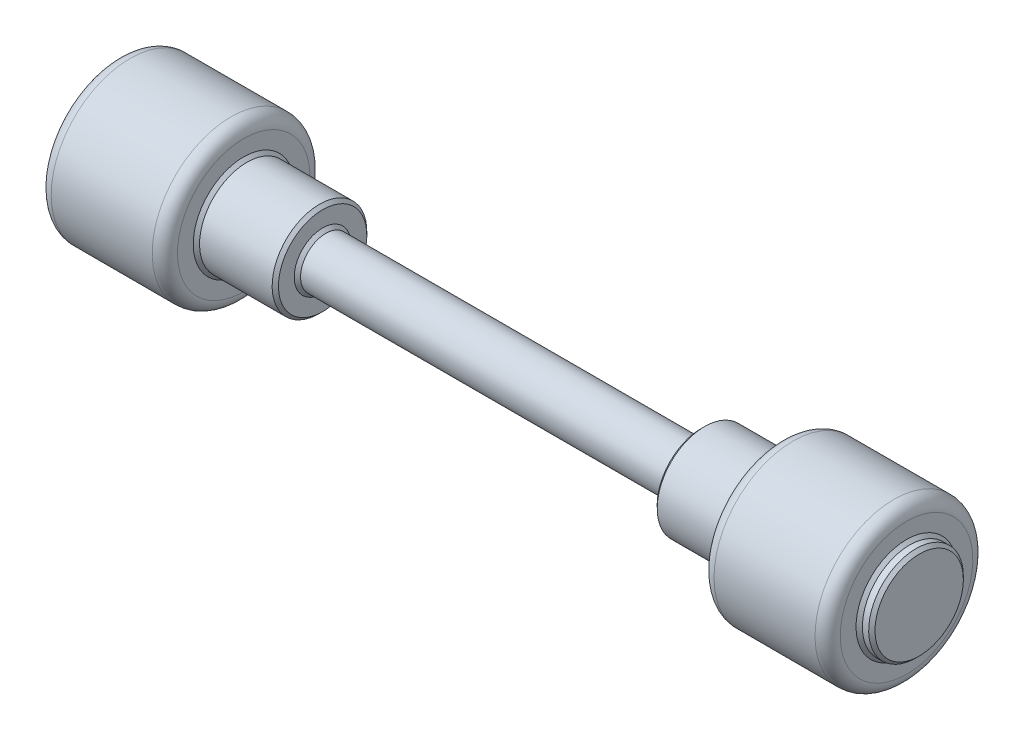
ISO-10303-21;
HEADER;
FILE_DESCRIPTION(('STEP AP214'),'2;1');
FILE_NAME('part.step','',(''),(''),'','','');
FILE_SCHEMA(('AUTOMOTIVE_DESIGN { 1 0 10303 214 1 1 1 1 }'));
ENDSEC;
DATA;
#1=APPLICATION_CONTEXT('core data for automotive mechanical design processes');
#2=APPLICATION_PROTOCOL_DEFINITION('international standard','automotive_design',2000,#1);
#3=PRODUCT_CONTEXT('',#1,'mechanical');
#4=PRODUCT('Part','Part','',(#3));
#5=PRODUCT_RELATED_PRODUCT_CATEGORY('part','',(#4));
#6=PRODUCT_DEFINITION_FORMATION('','',#4);
#7=PRODUCT_DEFINITION_CONTEXT('part definition',#1,'design');
#8=PRODUCT_DEFINITION('design','',#6,#7);
#9=PRODUCT_DEFINITION_SHAPE('','',#8);
#10=(LENGTH_UNIT() NAMED_UNIT(*) SI_UNIT(.MILLI.,.METRE.));
#11=(NAMED_UNIT(*) PLANE_ANGLE_UNIT() SI_UNIT($,.RADIAN.));
#12=(NAMED_UNIT(*) SI_UNIT($,.STERADIAN.) SOLID_ANGLE_UNIT());
#13=UNCERTAINTY_MEASURE_WITH_UNIT(LENGTH_MEASURE(1.E-05),#10,'distance_accuracy_value','');
#14=(GEOMETRIC_REPRESENTATION_CONTEXT(3) GLOBAL_UNCERTAINTY_ASSIGNED_CONTEXT((#13)) GLOBAL_UNIT_ASSIGNED_CONTEXT((#10,
#11,#12)) REPRESENTATION_CONTEXT('',''));
#15=CARTESIAN_POINT('',(0.,0.,0.));
#16=DIRECTION('',(0.,0.,1.));
#17=DIRECTION('',(1.,0.,0.));
#18=AXIS2_PLACEMENT_3D('',#15,#16,#17);
#19=CARTESIAN_POINT('',(1612.5,0.,0.));
#20=DIRECTION('',(1.,0.,0.));
#21=DIRECTION('',(0.,1.,0.));
#22=AXIS2_PLACEMENT_3D('',#19,#20,#21);
#23=CYLINDRICAL_SURFACE('',#22,312.500000000001);
#24=CARTESIAN_POINT('',(-1112.5,-3.49024337756995E-13,0.));
#25=DIRECTION('',(1.,0.,0.));
#26=DIRECTION('',(0.,1.,0.));
#27=AXIS2_PLACEMENT_3D('',#24,#25,#26);
#28=CIRCLE('',#27,312.500000000001);
#29=CARTESIAN_POINT('',(-1112.5,312.5,0.));
#30=VERTEX_POINT('',#29);
#31=EDGE_CURVE('E47',#30,#30,#28,.F.);
#32=ORIENTED_EDGE('',*,*,#31,.T.);
#33=EDGE_LOOP('',(#32));
#34=FACE_BOUND('',#33,.T.);
#35=CARTESIAN_POINT('',(-1512.5,-3.9801020972289E-13,0.));
#36=DIRECTION('',(-1.,0.,0.));
#37=DIRECTION('',(0.,-1.,0.));
#38=AXIS2_PLACEMENT_3D('',#35,#36,#37);
#39=CIRCLE('',#38,312.500000000001);
#40=CARTESIAN_POINT('',(-1512.5,-312.500000000001,0.));
#41=VERTEX_POINT('',#40);
#42=EDGE_CURVE('E52',#41,#41,#39,.F.);
#43=ORIENTED_EDGE('',*,*,#42,.T.);
#44=EDGE_LOOP('',(#43));
#45=FACE_BOUND('',#44,.T.);
#46=ADVANCED_FACE('F39',(#34,#45),#23,.T.);
#47=CARTESIAN_POINT('',(-1062.5,312.5,0.));
#48=DIRECTION('',(1.,0.,0.));
#49=DIRECTION('',(0.,1.,0.));
#50=AXIS2_PLACEMENT_3D('',#47,#48,#49);
#51=PLANE('',#50);
#52=CARTESIAN_POINT('',(-1062.5,-3.42901103761259E-13,0.));
#53=DIRECTION('',(1.,0.,0.));
#54=DIRECTION('',(0.,1.,0.));
#55=AXIS2_PLACEMENT_3D('',#52,#53,#54);
#56=CIRCLE('',#55,262.500000000001);
#57=CARTESIAN_POINT('',(-1062.5,262.5,0.));
#58=VERTEX_POINT('',#57);
#59=EDGE_CURVE('E57',#58,#58,#56,.T.);
#60=ORIENTED_EDGE('',*,*,#59,.T.);
#61=EDGE_LOOP('',(#60));
#62=FACE_BOUND('',#61,.T.);
#63=CARTESIAN_POINT('',(-1062.5,-3.42901103761259E-13,0.));
#64=DIRECTION('',(1.,0.,0.));
#65=DIRECTION('',(0.,1.,0.));
#66=AXIS2_PLACEMENT_3D('',#63,#64,#65);
#67=CIRCLE('',#66,200.000000000002);
#68=CARTESIAN_POINT('',(-1062.5,200.000000000001,0.));
#69=VERTEX_POINT('',#68);
#70=EDGE_CURVE('E79',#69,#69,#67,.F.);
#71=ORIENTED_EDGE('',*,*,#70,.T.);
#72=EDGE_LOOP('',(#71));
#73=FACE_BOUND('',#72,.T.);
#74=ADVANCED_FACE('F180',(#62,#73),#51,.T.);
#75=CARTESIAN_POINT('',(1612.5,0.,0.));
#76=DIRECTION('',(1.,0.,0.));
#77=DIRECTION('',(0.,1.,0.));
#78=AXIS2_PLACEMENT_3D('',#75,#76,#77);
#79=CYLINDRICAL_SURFACE('',#78,187.5);
#80=CARTESIAN_POINT('',(-762.5,-3.06161699786838E-13,0.));
#81=DIRECTION('',(1.,0.,0.));
#82=DIRECTION('',(0.,1.,0.));
#83=AXIS2_PLACEMENT_3D('',#80,#81,#82);
#84=CIRCLE('',#83,187.5);
#85=CARTESIAN_POINT('',(-762.5,187.5,0.));
#86=VERTEX_POINT('',#85);
#87=EDGE_CURVE('E83',#86,#86,#84,.F.);
#88=ORIENTED_EDGE('',*,*,#87,.T.);
#89=EDGE_LOOP('',(#88));
#90=FACE_BOUND('',#89,.T.);
#91=CARTESIAN_POINT('',(-1050.,-3.41370295262324E-13,0.));
#92=DIRECTION('',(1.,0.,0.));
#93=DIRECTION('',(0.,1.,0.));
#94=AXIS2_PLACEMENT_3D('',#91,#92,#93);
#95=CIRCLE('',#94,187.5);
#96=CARTESIAN_POINT('',(-1050.,187.5,0.));
#97=VERTEX_POINT('',#96);
#98=EDGE_CURVE('E87',#97,#97,#95,.T.);
#99=ORIENTED_EDGE('',*,*,#98,.T.);
#100=EDGE_LOOP('',(#99));
#101=FACE_BOUND('',#100,.T.);
#102=ADVANCED_FACE('F184',(#90,#101),#79,.T.);
#103=CARTESIAN_POINT('',(-750.,187.5,0.));
#104=DIRECTION('',(1.,0.,0.));
#105=DIRECTION('',(0.,1.,0.));
#106=AXIS2_PLACEMENT_3D('',#103,#104,#105);
#107=PLANE('',#106);
#108=CARTESIAN_POINT('',(-750.,-3.04630891287904E-13,0.));
#109=DIRECTION('',(1.,0.,0.));
#110=DIRECTION('',(0.,1.,0.));
#111=AXIS2_PLACEMENT_3D('',#108,#109,#110);
#112=CIRCLE('',#111,112.500000000001);
#113=CARTESIAN_POINT('',(-750.,112.500000000001,0.));
#114=VERTEX_POINT('',#113);
#115=EDGE_CURVE('E103',#114,#114,#112,.F.);
#116=ORIENTED_EDGE('',*,*,#115,.T.);
#117=EDGE_LOOP('',(#116));
#118=FACE_BOUND('',#117,.T.);
#119=CARTESIAN_POINT('',(-750.,-3.04630891287904E-13,0.));
#120=DIRECTION('',(1.,0.,0.));
#121=DIRECTION('',(0.,1.,0.));
#122=AXIS2_PLACEMENT_3D('',#119,#120,#121);
#123=CIRCLE('',#122,175.);
#124=CARTESIAN_POINT('',(-750.,175.,0.));
#125=VERTEX_POINT('',#124);
#126=EDGE_CURVE('E107',#125,#125,#123,.T.);
#127=ORIENTED_EDGE('',*,*,#126,.T.);
#128=EDGE_LOOP('',(#127));
#129=FACE_BOUND('',#128,.T.);
#130=ADVANCED_FACE('F191',(#118,#129),#107,.T.);
#131=CARTESIAN_POINT('',(1612.5,0.,0.));
#132=DIRECTION('',(1.,0.,0.));
#133=DIRECTION('',(0.,1.,0.));
#134=AXIS2_PLACEMENT_3D('',#131,#132,#133);
#135=CYLINDRICAL_SURFACE('',#134,100.);
#136=CARTESIAN_POINT('',(737.5,-1.22464679914735E-13,0.));
#137=DIRECTION('',(-1.,0.,0.));
#138=DIRECTION('',(0.,-1.,0.));
#139=AXIS2_PLACEMENT_3D('',#136,#137,#138);
#140=CIRCLE('',#139,100.);
#141=CARTESIAN_POINT('',(737.5,-100.,0.));
#142=VERTEX_POINT('',#141);
#143=EDGE_CURVE('E111',#142,#142,#140,.T.);
#144=ORIENTED_EDGE('',*,*,#143,.T.);
#145=EDGE_LOOP('',(#144));
#146=FACE_BOUND('',#145,.T.);
#147=CARTESIAN_POINT('',(-737.499999999998,-3.0310008278897E-13,0.));
#148=DIRECTION('',(1.,0.,0.));
#149=DIRECTION('',(0.,1.,0.));
#150=AXIS2_PLACEMENT_3D('',#147,#148,#149);
#151=CIRCLE('',#150,100.);
#152=CARTESIAN_POINT('',(-737.499999999998,99.9999999999998,0.));
#153=VERTEX_POINT('',#152);
#154=EDGE_CURVE('E115',#153,#153,#151,.T.);
#155=ORIENTED_EDGE('',*,*,#154,.T.);
#156=EDGE_LOOP('',(#155));
#157=FACE_BOUND('',#156,.T.);
#158=ADVANCED_FACE('F195',(#146,#157),#135,.T.);
#159=CARTESIAN_POINT('',(750.,99.9999999999998,0.));
#160=DIRECTION('',(-1.,0.,0.));
#161=DIRECTION('',(0.,-1.,0.));
#162=AXIS2_PLACEMENT_3D('',#159,#160,#161);
#163=PLANE('',#162);
#164=CARTESIAN_POINT('',(750.,-1.20933871415801E-13,0.));
#165=DIRECTION('',(-1.,0.,0.));
#166=DIRECTION('',(0.,-1.,0.));
#167=AXIS2_PLACEMENT_3D('',#164,#165,#166);
#168=CIRCLE('',#167,112.5);
#169=CARTESIAN_POINT('',(750.,-112.5,0.));
#170=VERTEX_POINT('',#169);
#171=EDGE_CURVE('E119',#170,#170,#168,.F.);
#172=ORIENTED_EDGE('',*,*,#171,.T.);
#173=EDGE_LOOP('',(#172));
#174=FACE_BOUND('',#173,.T.);
#175=CARTESIAN_POINT('',(750.,-1.20933871415801E-13,0.));
#176=DIRECTION('',(-1.,0.,0.));
#177=DIRECTION('',(0.,-1.,0.));
#178=AXIS2_PLACEMENT_3D('',#175,#176,#177);
#179=CIRCLE('',#178,174.999999999999);
#180=CARTESIAN_POINT('',(750.,-174.999999999999,0.));
#181=VERTEX_POINT('',#180);
#182=EDGE_CURVE('E123',#181,#181,#179,.T.);
#183=ORIENTED_EDGE('',*,*,#182,.T.);
#184=EDGE_LOOP('',(#183));
#185=FACE_BOUND('',#184,.T.);
#186=ADVANCED_FACE('F199',(#174,#185),#163,.T.);
#187=CARTESIAN_POINT('',(1612.5,0.,0.));
#188=DIRECTION('',(1.,0.,0.));
#189=DIRECTION('',(0.,1.,0.));
#190=AXIS2_PLACEMENT_3D('',#187,#188,#189);
#191=CYLINDRICAL_SURFACE('',#190,187.5);
#192=CARTESIAN_POINT('',(1050.,0.,0.));
#193=DIRECTION('',(-1.,0.,0.));
#194=DIRECTION('',(0.,-1.,0.));
#195=AXIS2_PLACEMENT_3D('',#192,#193,#194);
#196=CIRCLE('',#195,187.5);
#197=CARTESIAN_POINT('',(1050.,-187.5,0.));
#198=VERTEX_POINT('',#197);
#199=EDGE_CURVE('E91',#198,#198,#196,.T.);
#200=ORIENTED_EDGE('',*,*,#199,.T.);
#201=EDGE_LOOP('',(#200));
#202=FACE_BOUND('',#201,.T.);
#203=CARTESIAN_POINT('',(762.500000000001,-1.19403062916867E-13,0.));
#204=DIRECTION('',(-1.,0.,0.));
#205=DIRECTION('',(0.,-1.,0.));
#206=AXIS2_PLACEMENT_3D('',#203,#204,#205);
#207=CIRCLE('',#206,187.5);
#208=CARTESIAN_POINT('',(762.500000000001,-187.5,0.));
#209=VERTEX_POINT('',#208);
#210=EDGE_CURVE('E95',#209,#209,#207,.F.);
#211=ORIENTED_EDGE('',*,*,#210,.T.);
#212=EDGE_LOOP('',(#211));
#213=FACE_BOUND('',#212,.T.);
#214=ADVANCED_FACE('F203',(#202,#213),#191,.T.);
#215=CARTESIAN_POINT('',(1062.5,187.5,0.));
#216=DIRECTION('',(-1.,0.,0.));
#217=DIRECTION('',(0.,-1.,0.));
#218=AXIS2_PLACEMENT_3D('',#215,#216,#217);
#219=PLANE('',#218);
#220=CARTESIAN_POINT('',(1062.5,0.,0.));
#221=DIRECTION('',(-1.,0.,0.));
#222=DIRECTION('',(0.,-1.,0.));
#223=AXIS2_PLACEMENT_3D('',#220,#221,#222);
#224=CIRCLE('',#223,262.5);
#225=CARTESIAN_POINT('',(1062.5,-262.5,0.));
#226=VERTEX_POINT('',#225);
#227=EDGE_CURVE('E63',#226,#226,#224,.T.);
#228=ORIENTED_EDGE('',*,*,#227,.T.);
#229=EDGE_LOOP('',(#228));
#230=FACE_BOUND('',#229,.T.);
#231=CARTESIAN_POINT('',(1062.5,0.,0.));
#232=DIRECTION('',(-1.,0.,0.));
#233=DIRECTION('',(0.,-1.,0.));
#234=AXIS2_PLACEMENT_3D('',#231,#232,#233);
#235=CIRCLE('',#234,200.);
#236=CARTESIAN_POINT('',(1062.5,-200.,0.));
#237=VERTEX_POINT('',#236);
#238=EDGE_CURVE('E99',#237,#237,#235,.F.);
#239=ORIENTED_EDGE('',*,*,#238,.T.);
#240=EDGE_LOOP('',(#239));
#241=FACE_BOUND('',#240,.T.);
#242=ADVANCED_FACE('F207',(#230,#241),#219,.T.);
#243=CARTESIAN_POINT('',(1612.5,0.,0.));
#244=DIRECTION('',(1.,0.,0.));
#245=DIRECTION('',(0.,1.,0.));
#246=AXIS2_PLACEMENT_3D('',#243,#244,#245);
#247=CYLINDRICAL_SURFACE('',#246,312.5);
#248=CARTESIAN_POINT('',(1512.5,0.,0.));
#249=DIRECTION('',(1.,0.,0.));
#250=DIRECTION('',(0.,1.,0.));
#251=AXIS2_PLACEMENT_3D('',#248,#249,#250);
#252=CIRCLE('',#251,312.5);
#253=CARTESIAN_POINT('',(1512.5,312.5,0.));
#254=VERTEX_POINT('',#253);
#255=EDGE_CURVE('E67',#254,#254,#252,.F.);
#256=ORIENTED_EDGE('',*,*,#255,.T.);
#257=EDGE_LOOP('',(#256));
#258=FACE_BOUND('',#257,.T.);
#259=CARTESIAN_POINT('',(1112.5,0.,0.));
#260=DIRECTION('',(-1.,0.,0.));
#261=DIRECTION('',(0.,-1.,0.));
#262=AXIS2_PLACEMENT_3D('',#259,#260,#261);
#263=CIRCLE('',#262,312.5);
#264=CARTESIAN_POINT('',(1112.5,-312.5,0.));
#265=VERTEX_POINT('',#264);
#266=EDGE_CURVE('E71',#265,#265,#263,.F.);
#267=ORIENTED_EDGE('',*,*,#266,.T.);
#268=EDGE_LOOP('',(#267));
#269=FACE_BOUND('',#268,.T.);
#270=ADVANCED_FACE('F211',(#258,#269),#247,.T.);
#271=CARTESIAN_POINT('',(1562.5,312.5,0.));
#272=DIRECTION('',(1.,0.,0.));
#273=DIRECTION('',(0.,1.,0.));
#274=AXIS2_PLACEMENT_3D('',#271,#272,#273);
#275=PLANE('',#274);
#276=CARTESIAN_POINT('',(1562.5,0.,0.));
#277=DIRECTION('',(1.,0.,0.));
#278=DIRECTION('',(0.,1.,0.));
#279=AXIS2_PLACEMENT_3D('',#276,#277,#278);
#280=CIRCLE('',#279,262.5);
#281=CARTESIAN_POINT('',(1562.5,262.5,0.));
#282=VERTEX_POINT('',#281);
#283=EDGE_CURVE('E75',#282,#282,#280,.T.);
#284=ORIENTED_EDGE('',*,*,#283,.T.);
#285=EDGE_LOOP('',(#284));
#286=FACE_BOUND('',#285,.T.);
#287=CARTESIAN_POINT('',(1562.5,0.,0.));
#288=DIRECTION('',(1.,0.,0.));
#289=DIRECTION('',(0.,1.,0.));
#290=AXIS2_PLACEMENT_3D('',#287,#288,#289);
#291=CIRCLE('',#290,200.);
#292=CARTESIAN_POINT('',(1562.5,200.,0.));
#293=VERTEX_POINT('',#292);
#294=EDGE_CURVE('E127',#293,#293,#291,.F.);
#295=ORIENTED_EDGE('',*,*,#294,.T.);
#296=EDGE_LOOP('',(#295));
#297=FACE_BOUND('',#296,.T.);
#298=ADVANCED_FACE('F215',(#286,#297),#275,.T.);
#299=CARTESIAN_POINT('',(1612.5,0.,0.));
#300=DIRECTION('',(1.,0.,0.));
#301=DIRECTION('',(0.,1.,0.));
#302=AXIS2_PLACEMENT_3D('',#299,#300,#301);
#303=CYLINDRICAL_SURFACE('',#302,187.5);
#304=CARTESIAN_POINT('',(1600.,0.,0.));
#305=DIRECTION('',(1.,0.,0.));
#306=DIRECTION('',(0.,1.,0.));
#307=AXIS2_PLACEMENT_3D('',#304,#305,#306);
#308=CIRCLE('',#307,187.5);
#309=CARTESIAN_POINT('',(1600.,187.5,0.));
#310=VERTEX_POINT('',#309);
#311=EDGE_CURVE('E131',#310,#310,#308,.F.);
#312=ORIENTED_EDGE('',*,*,#311,.T.);
#313=EDGE_LOOP('',(#312));
#314=FACE_BOUND('',#313,.T.);
#315=CARTESIAN_POINT('',(1575.,0.,0.));
#316=DIRECTION('',(1.,0.,0.));
#317=DIRECTION('',(0.,1.,0.));
#318=AXIS2_PLACEMENT_3D('',#315,#316,#317);
#319=CIRCLE('',#318,187.5);
#320=CARTESIAN_POINT('',(1575.,187.5,0.));
#321=VERTEX_POINT('',#320);
#322=EDGE_CURVE('E135',#321,#321,#319,.T.);
#323=ORIENTED_EDGE('',*,*,#322,.T.);
#324=EDGE_LOOP('',(#323));
#325=FACE_BOUND('',#324,.T.);
#326=ADVANCED_FACE('F219',(#314,#325),#303,.T.);
#327=CARTESIAN_POINT('',(1612.5,187.5,0.));
#328=DIRECTION('',(1.,0.,0.));
#329=DIRECTION('',(0.,1.,0.));
#330=AXIS2_PLACEMENT_3D('',#327,#328,#329);
#331=PLANE('',#330);
#332=CARTESIAN_POINT('',(1612.5,0.,0.));
#333=DIRECTION('',(1.,0.,0.));
#334=DIRECTION('',(0.,1.,0.));
#335=AXIS2_PLACEMENT_3D('',#332,#333,#334);
#336=CIRCLE('',#335,175.);
#337=CARTESIAN_POINT('',(1612.5,175.,0.));
#338=VERTEX_POINT('',#337);
#339=EDGE_CURVE('E139',#338,#338,#336,.T.);
#340=ORIENTED_EDGE('',*,*,#339,.T.);
#341=EDGE_LOOP('',(#340));
#342=FACE_BOUND('',#341,.T.);
#343=ADVANCED_FACE('F223',(#342),#331,.T.);
#344=CARTESIAN_POINT('',(-1612.5,-4.10256677714363E-13,0.));
#345=DIRECTION('',(-1.,0.,0.));
#346=DIRECTION('',(0.,-1.,0.));
#347=AXIS2_PLACEMENT_3D('',#344,#345,#346);
#348=PLANE('',#347);
#349=CARTESIAN_POINT('',(-1612.5,-4.10256677714363E-13,0.));
#350=DIRECTION('',(-1.,0.,0.));
#351=DIRECTION('',(0.,-1.,0.));
#352=AXIS2_PLACEMENT_3D('',#349,#350,#351);
#353=CIRCLE('',#352,175.000000000001);
#354=CARTESIAN_POINT('',(-1612.5,-175.000000000001,0.));
#355=VERTEX_POINT('',#354);
#356=EDGE_CURVE('E143',#355,#355,#353,.T.);
#357=ORIENTED_EDGE('',*,*,#356,.T.);
#358=EDGE_LOOP('',(#357));
#359=FACE_BOUND('',#358,.T.);
#360=ADVANCED_FACE('F227',(#359),#348,.T.);
#361=CARTESIAN_POINT('',(1612.5,0.,0.));
#362=DIRECTION('',(1.,0.,0.));
#363=DIRECTION('',(0.,1.,0.));
#364=AXIS2_PLACEMENT_3D('',#361,#362,#363);
#365=CYLINDRICAL_SURFACE('',#364,187.500000000001);
#366=CARTESIAN_POINT('',(-1575.,-4.05664252217561E-13,0.));
#367=DIRECTION('',(-1.,0.,0.));
#368=DIRECTION('',(0.,-1.,0.));
#369=AXIS2_PLACEMENT_3D('',#366,#367,#368);
#370=CIRCLE('',#369,187.500000000001);
#371=CARTESIAN_POINT('',(-1575.,-187.500000000001,0.));
#372=VERTEX_POINT('',#371);
#373=EDGE_CURVE('E147',#372,#372,#370,.T.);
#374=ORIENTED_EDGE('',*,*,#373,.T.);
#375=EDGE_LOOP('',(#374));
#376=FACE_BOUND('',#375,.T.);
#377=CARTESIAN_POINT('',(-1600.,-4.08725869215429E-13,0.));
#378=DIRECTION('',(-1.,0.,0.));
#379=DIRECTION('',(0.,-1.,0.));
#380=AXIS2_PLACEMENT_3D('',#377,#378,#379);
#381=CIRCLE('',#380,187.500000000001);
#382=CARTESIAN_POINT('',(-1600.,-187.500000000001,0.));
#383=VERTEX_POINT('',#382);
#384=EDGE_CURVE('E151',#383,#383,#381,.F.);
#385=ORIENTED_EDGE('',*,*,#384,.T.);
#386=EDGE_LOOP('',(#385));
#387=FACE_BOUND('',#386,.T.);
#388=ADVANCED_FACE('F174',(#376,#387),#365,.T.);
#389=CARTESIAN_POINT('',(-1562.5,187.500000000001,0.));
#390=DIRECTION('',(-1.,0.,0.));
#391=DIRECTION('',(0.,-1.,0.));
#392=AXIS2_PLACEMENT_3D('',#389,#390,#391);
#393=PLANE('',#392);
#394=CARTESIAN_POINT('',(-1562.5,-4.04133443718626E-13,0.));
#395=DIRECTION('',(-1.,0.,0.));
#396=DIRECTION('',(0.,-1.,0.));
#397=AXIS2_PLACEMENT_3D('',#394,#395,#396);
#398=CIRCLE('',#397,262.500000000001);
#399=CARTESIAN_POINT('',(-1562.5,-262.500000000001,0.));
#400=VERTEX_POINT('',#399);
#401=EDGE_CURVE('E10',#400,#400,#398,.T.);
#402=ORIENTED_EDGE('',*,*,#401,.T.);
#403=EDGE_LOOP('',(#402));
#404=FACE_BOUND('',#403,.T.);
#405=CARTESIAN_POINT('',(-1562.5,-4.04133443718626E-13,0.));
#406=DIRECTION('',(-1.,0.,0.));
#407=DIRECTION('',(0.,-1.,0.));
#408=AXIS2_PLACEMENT_3D('',#405,#406,#407);
#409=CIRCLE('',#408,200.000000000001);
#410=CARTESIAN_POINT('',(-1562.5,-200.000000000001,0.));
#411=VERTEX_POINT('',#410);
#412=EDGE_CURVE('E155',#411,#411,#409,.F.);
#413=ORIENTED_EDGE('',*,*,#412,.T.);
#414=EDGE_LOOP('',(#413));
#415=FACE_BOUND('',#414,.T.);
#416=ADVANCED_FACE('F160',(#404,#415),#393,.T.);
#417=CARTESIAN_POINT('',(-1562.5,-4.04133443718626E-13,0.));
#418=DIRECTION('',(1.,0.,0.));
#419=DIRECTION('',(0.,1.,0.));
#420=AXIS2_PLACEMENT_3D('',#417,#418,#419);
#421=CONICAL_SURFACE('',#420,200.000000000001,0.785398163397446);
#422=ORIENTED_EDGE('',*,*,#373,.F.);
#423=EDGE_LOOP('',(#422));
#424=FACE_BOUND('',#423,.T.);
#425=ORIENTED_EDGE('',*,*,#412,.F.);
#426=EDGE_LOOP('',(#425));
#427=FACE_BOUND('',#426,.T.);
#428=ADVANCED_FACE('F162',(#424,#427),#421,.T.);
#429=CARTESIAN_POINT('',(-1600.,-4.08725869215429E-13,0.));
#430=DIRECTION('',(1.,0.,0.));
#431=DIRECTION('',(0.,1.,0.));
#432=AXIS2_PLACEMENT_3D('',#429,#430,#431);
#433=CONICAL_SURFACE('',#432,187.500000000001,0.785398163397432);
#434=ORIENTED_EDGE('',*,*,#356,.F.);
#435=EDGE_LOOP('',(#434));
#436=FACE_BOUND('',#435,.T.);
#437=ORIENTED_EDGE('',*,*,#384,.F.);
#438=EDGE_LOOP('',(#437));
#439=FACE_BOUND('',#438,.T.);
#440=ADVANCED_FACE('F164',(#436,#439),#433,.T.);
#441=CARTESIAN_POINT('',(1612.5,0.,0.));
#442=DIRECTION('',(-1.,0.,0.));
#443=DIRECTION('',(0.,-1.,0.));
#444=AXIS2_PLACEMENT_3D('',#441,#442,#443);
#445=CONICAL_SURFACE('',#444,175.,0.785398163397445);
#446=ORIENTED_EDGE('',*,*,#311,.F.);
#447=EDGE_LOOP('',(#446));
#448=FACE_BOUND('',#447,.T.);
#449=ORIENTED_EDGE('',*,*,#339,.F.);
#450=EDGE_LOOP('',(#449));
#451=FACE_BOUND('',#450,.T.);
#452=ADVANCED_FACE('F171',(#448,#451),#445,.T.);
#453=CARTESIAN_POINT('',(1575.,0.,0.));
#454=DIRECTION('',(-1.,0.,0.));
#455=DIRECTION('',(0.,-1.,0.));
#456=AXIS2_PLACEMENT_3D('',#453,#454,#455);
#457=CONICAL_SURFACE('',#456,187.5,0.785398163397442);
#458=ORIENTED_EDGE('',*,*,#294,.F.);
#459=EDGE_LOOP('',(#458));
#460=FACE_BOUND('',#459,.T.);
#461=ORIENTED_EDGE('',*,*,#322,.F.);
#462=EDGE_LOOP('',(#461));
#463=FACE_BOUND('',#462,.T.);
#464=ADVANCED_FACE('F338',(#460,#463),#457,.T.);
#465=CARTESIAN_POINT('',(750.,-1.20933871415801E-13,0.));
#466=DIRECTION('',(1.,0.,0.));
#467=DIRECTION('',(0.,1.,0.));
#468=AXIS2_PLACEMENT_3D('',#465,#466,#467);
#469=CONICAL_SURFACE('',#468,112.5,0.785398163397442);
#470=ORIENTED_EDGE('',*,*,#143,.F.);
#471=EDGE_LOOP('',(#470));
#472=FACE_BOUND('',#471,.T.);
#473=ORIENTED_EDGE('',*,*,#171,.F.);
#474=EDGE_LOOP('',(#473));
#475=FACE_BOUND('',#474,.T.);
#476=ADVANCED_FACE('F331',(#472,#475),#469,.T.);
#477=CARTESIAN_POINT('',(-737.499999999998,-3.0310008278897E-13,0.));
#478=DIRECTION('',(-1.,0.,0.));
#479=DIRECTION('',(0.,-1.,0.));
#480=AXIS2_PLACEMENT_3D('',#477,#478,#479);
#481=CONICAL_SURFACE('',#480,100.,0.785398163397429);
#482=ORIENTED_EDGE('',*,*,#115,.F.);
#483=EDGE_LOOP('',(#482));
#484=FACE_BOUND('',#483,.T.);
#485=ORIENTED_EDGE('',*,*,#154,.F.);
#486=EDGE_LOOP('',(#485));
#487=FACE_BOUND('',#486,.T.);
#488=ADVANCED_FACE('F324',(#484,#487),#481,.T.);
#489=CARTESIAN_POINT('',(1062.5,0.,0.));
#490=DIRECTION('',(1.,0.,0.));
#491=DIRECTION('',(0.,1.,0.));
#492=AXIS2_PLACEMENT_3D('',#489,#490,#491);
#493=CONICAL_SURFACE('',#492,200.,0.785398163397463);
#494=ORIENTED_EDGE('',*,*,#199,.F.);
#495=EDGE_LOOP('',(#494));
#496=FACE_BOUND('',#495,.T.);
#497=ORIENTED_EDGE('',*,*,#238,.F.);
#498=EDGE_LOOP('',(#497));
#499=FACE_BOUND('',#498,.T.);
#500=ADVANCED_FACE('F317',(#496,#499),#493,.T.);
#501=CARTESIAN_POINT('',(762.500000000001,-1.19403062916867E-13,0.));
#502=DIRECTION('',(1.,0.,0.));
#503=DIRECTION('',(0.,1.,0.));
#504=AXIS2_PLACEMENT_3D('',#501,#502,#503);
#505=CONICAL_SURFACE('',#504,187.5,0.785398163397439);
#506=ORIENTED_EDGE('',*,*,#182,.F.);
#507=EDGE_LOOP('',(#506));
#508=FACE_BOUND('',#507,.T.);
#509=ORIENTED_EDGE('',*,*,#210,.F.);
#510=EDGE_LOOP('',(#509));
#511=FACE_BOUND('',#510,.T.);
#512=ADVANCED_FACE('F310',(#508,#511),#505,.T.);
#513=CARTESIAN_POINT('',(-750.,-3.04630891287904E-13,0.));
#514=DIRECTION('',(-1.,0.,0.));
#515=DIRECTION('',(0.,-1.,0.));
#516=AXIS2_PLACEMENT_3D('',#513,#514,#515);
#517=CONICAL_SURFACE('',#516,175.,0.785398163397445);
#518=ORIENTED_EDGE('',*,*,#87,.F.);
#519=EDGE_LOOP('',(#518));
#520=FACE_BOUND('',#519,.T.);
#521=ORIENTED_EDGE('',*,*,#126,.F.);
#522=EDGE_LOOP('',(#521));
#523=FACE_BOUND('',#522,.T.);
#524=ADVANCED_FACE('F303',(#520,#523),#517,.T.);
#525=CARTESIAN_POINT('',(-1050.,-3.41370295262324E-13,0.));
#526=DIRECTION('',(-1.,0.,0.));
#527=DIRECTION('',(0.,-1.,0.));
#528=AXIS2_PLACEMENT_3D('',#525,#526,#527);
#529=CONICAL_SURFACE('',#528,187.5,0.78539816339745);
#530=ORIENTED_EDGE('',*,*,#70,.F.);
#531=EDGE_LOOP('',(#530));
#532=FACE_BOUND('',#531,.T.);
#533=ORIENTED_EDGE('',*,*,#98,.F.);
#534=EDGE_LOOP('',(#533));
#535=FACE_BOUND('',#534,.T.);
#536=ADVANCED_FACE('F261',(#532,#535),#529,.T.);
#537=CARTESIAN_POINT('',(1512.5,0.,0.));
#538=DIRECTION('',(1.,0.,0.));
#539=DIRECTION('',(0.,1.,0.));
#540=AXIS2_PLACEMENT_3D('',#537,#538,#539);
#541=TOROIDAL_SURFACE('',#540,262.5,50.);
#542=ORIENTED_EDGE('',*,*,#255,.F.);
#543=EDGE_LOOP('',(#542));
#544=FACE_BOUND('',#543,.T.);
#545=ORIENTED_EDGE('',*,*,#283,.F.);
#546=EDGE_LOOP('',(#545));
#547=FACE_BOUND('',#546,.T.);
#548=ADVANCED_FACE('F255',(#544,#547),#541,.T.);
#549=CARTESIAN_POINT('',(1112.5,0.,0.));
#550=DIRECTION('',(-1.,0.,0.));
#551=DIRECTION('',(0.,-1.,0.));
#552=AXIS2_PLACEMENT_3D('',#549,#550,#551);
#553=TOROIDAL_SURFACE('',#552,262.5,50.);
#554=ORIENTED_EDGE('',*,*,#227,.F.);
#555=EDGE_LOOP('',(#554));
#556=FACE_BOUND('',#555,.T.);
#557=ORIENTED_EDGE('',*,*,#266,.F.);
#558=EDGE_LOOP('',(#557));
#559=FACE_BOUND('',#558,.T.);
#560=ADVANCED_FACE('F260',(#556,#559),#553,.T.);
#561=CARTESIAN_POINT('',(-1112.5,-3.49024337756995E-13,0.));
#562=DIRECTION('',(1.,0.,0.));
#563=DIRECTION('',(0.,1.,0.));
#564=AXIS2_PLACEMENT_3D('',#561,#562,#563);
#565=TOROIDAL_SURFACE('',#564,262.500000000001,50.);
#566=ORIENTED_EDGE('',*,*,#31,.F.);
#567=EDGE_LOOP('',(#566));
#568=FACE_BOUND('',#567,.T.);
#569=ORIENTED_EDGE('',*,*,#59,.F.);
#570=EDGE_LOOP('',(#569));
#571=FACE_BOUND('',#570,.T.);
#572=ADVANCED_FACE('F273',(#568,#571),#565,.T.);
#573=CARTESIAN_POINT('',(-1512.5,-3.9801020972289E-13,0.));
#574=DIRECTION('',(-1.,0.,0.));
#575=DIRECTION('',(0.,-1.,0.));
#576=AXIS2_PLACEMENT_3D('',#573,#574,#575);
#577=TOROIDAL_SURFACE('',#576,262.500000000001,50.);
#578=ORIENTED_EDGE('',*,*,#401,.F.);
#579=EDGE_LOOP('',(#578));
#580=FACE_BOUND('',#579,.T.);
#581=ORIENTED_EDGE('',*,*,#42,.F.);
#582=EDGE_LOOP('',(#581));
#583=FACE_BOUND('',#582,.T.);
#584=ADVANCED_FACE('F41',(#580,#583),#577,.T.);
#585=CLOSED_SHELL('',(#46,#74,#102,#130,#158,#186,#214,#242,#270,#298,#326,#343,#360,#388,#416,
#428,#440,#452,#464,#476,#488,#500,#512,#524,#536,#548,#560,#572,#584));
#586=MANIFOLD_SOLID_BREP('B2',#585);
#587=ADVANCED_BREP_SHAPE_REPRESENTATION('',(#18,#586),#14);
#588=SHAPE_DEFINITION_REPRESENTATION(#9,#587);
ENDSEC;
END-ISO-10303-21;
